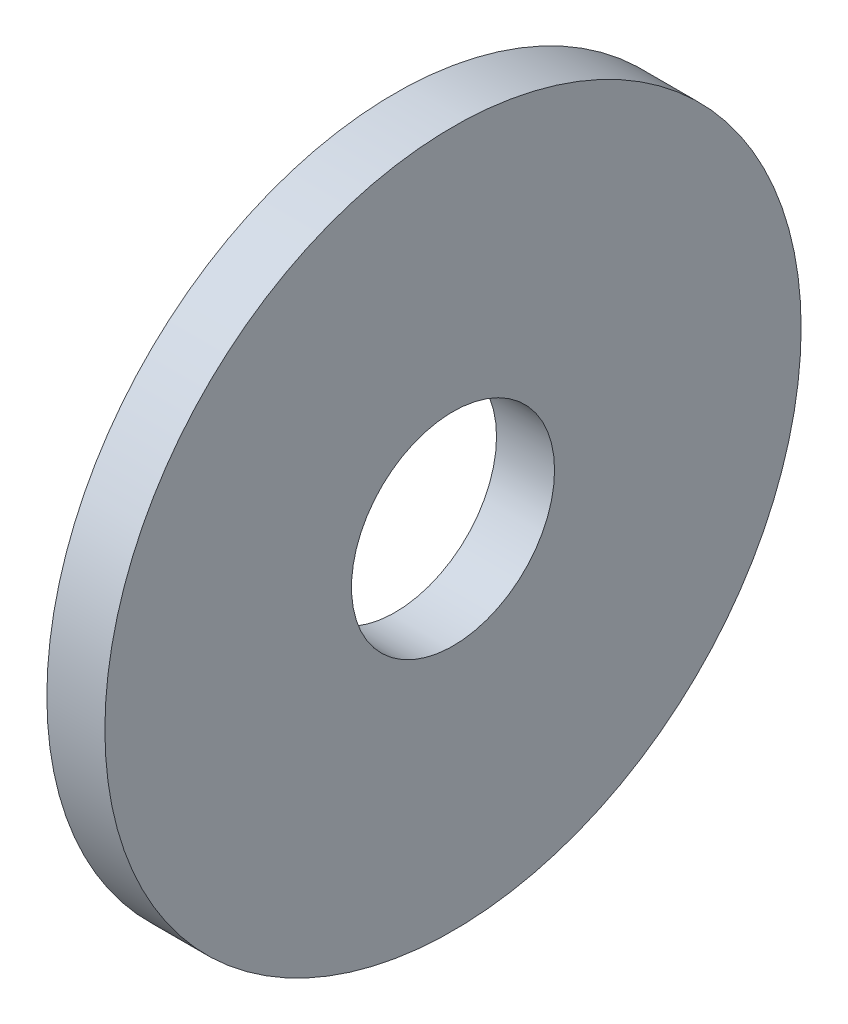
ISO-10303-21;
HEADER;
FILE_DESCRIPTION(('STEP AP214'),'2;1');
FILE_NAME('part.step','',(''),(''),'','','');
FILE_SCHEMA(('AUTOMOTIVE_DESIGN { 1 0 10303 214 1 1 1 1 }'));
ENDSEC;
DATA;
#1=APPLICATION_CONTEXT('core data for automotive mechanical design processes');
#2=APPLICATION_PROTOCOL_DEFINITION('international standard','automotive_design',2000,#1);
#3=PRODUCT_CONTEXT('',#1,'mechanical');
#4=PRODUCT('Part','Part','',(#3));
#5=PRODUCT_RELATED_PRODUCT_CATEGORY('part','',(#4));
#6=PRODUCT_DEFINITION_FORMATION('','',#4);
#7=PRODUCT_DEFINITION_CONTEXT('part definition',#1,'design');
#8=PRODUCT_DEFINITION('design','',#6,#7);
#9=PRODUCT_DEFINITION_SHAPE('','',#8);
#10=(LENGTH_UNIT() NAMED_UNIT(*) SI_UNIT(.MILLI.,.METRE.));
#11=(NAMED_UNIT(*) PLANE_ANGLE_UNIT() SI_UNIT($,.RADIAN.));
#12=(NAMED_UNIT(*) SI_UNIT($,.STERADIAN.) SOLID_ANGLE_UNIT());
#13=UNCERTAINTY_MEASURE_WITH_UNIT(LENGTH_MEASURE(1.E-05),#10,'distance_accuracy_value','');
#14=(GEOMETRIC_REPRESENTATION_CONTEXT(3) GLOBAL_UNCERTAINTY_ASSIGNED_CONTEXT((#13)) GLOBAL_UNIT_ASSIGNED_CONTEXT((#10,
#11,#12)) REPRESENTATION_CONTEXT('',''));
#15=CARTESIAN_POINT('',(0.,0.,0.));
#16=DIRECTION('',(0.,0.,1.));
#17=DIRECTION('',(1.,0.,0.));
#18=AXIS2_PLACEMENT_3D('',#15,#16,#17);
#19=CARTESIAN_POINT('',(1.,0.,0.));
#20=DIRECTION('',(1.,0.,0.));
#21=DIRECTION('',(0.,0.,-1.));
#22=AXIS2_PLACEMENT_3D('',#19,#20,#21);
#23=PLANE('',#22);
#24=CARTESIAN_POINT('',(1.,0.,0.));
#25=DIRECTION('',(1.,0.,0.));
#26=DIRECTION('',(0.,0.,-1.));
#27=AXIS2_PLACEMENT_3D('',#24,#25,#26);
#28=CIRCLE('',#27,6.);
#29=CARTESIAN_POINT('',(1.,0.,-6.));
#30=VERTEX_POINT('',#29);
#31=EDGE_CURVE('E10',#30,#30,#28,.T.);
#32=ORIENTED_EDGE('',*,*,#31,.T.);
#33=EDGE_LOOP('',(#32));
#34=FACE_BOUND('',#33,.T.);
#35=CARTESIAN_POINT('',(1.,0.,0.));
#36=DIRECTION('',(1.,0.,0.));
#37=DIRECTION('',(0.,0.,-1.));
#38=AXIS2_PLACEMENT_3D('',#35,#36,#37);
#39=CIRCLE('',#38,1.75);
#40=CARTESIAN_POINT('',(1.,0.,-1.75));
#41=VERTEX_POINT('',#40);
#42=EDGE_CURVE('E41',#41,#41,#39,.T.);
#43=ORIENTED_EDGE('',*,*,#42,.F.);
#44=EDGE_LOOP('',(#43));
#45=FACE_BOUND('',#44,.T.);
#46=ADVANCED_FACE('F30',(#34,#45),#23,.T.);
#47=CARTESIAN_POINT('',(0.,0.,0.));
#48=DIRECTION('',(1.,0.,0.));
#49=DIRECTION('',(0.,0.,-1.));
#50=AXIS2_PLACEMENT_3D('',#47,#48,#49);
#51=PLANE('',#50);
#52=CARTESIAN_POINT('',(0.,0.,0.));
#53=DIRECTION('',(1.,0.,0.));
#54=DIRECTION('',(0.,0.,-1.));
#55=AXIS2_PLACEMENT_3D('',#52,#53,#54);
#56=CIRCLE('',#55,6.);
#57=CARTESIAN_POINT('',(0.,0.,-6.));
#58=VERTEX_POINT('',#57);
#59=EDGE_CURVE('E34',#58,#58,#56,.T.);
#60=ORIENTED_EDGE('',*,*,#59,.F.);
#61=EDGE_LOOP('',(#60));
#62=FACE_BOUND('',#61,.T.);
#63=CARTESIAN_POINT('',(0.,0.,0.));
#64=DIRECTION('',(1.,0.,0.));
#65=DIRECTION('',(0.,0.,-1.));
#66=AXIS2_PLACEMENT_3D('',#63,#64,#65);
#67=CIRCLE('',#66,1.75);
#68=CARTESIAN_POINT('',(0.,0.,-1.75));
#69=VERTEX_POINT('',#68);
#70=EDGE_CURVE('E43',#69,#69,#67,.T.);
#71=ORIENTED_EDGE('',*,*,#70,.T.);
#72=EDGE_LOOP('',(#71));
#73=FACE_BOUND('',#72,.T.);
#74=ADVANCED_FACE('F53',(#62,#73),#51,.F.);
#75=CARTESIAN_POINT('',(1.,0.,0.));
#76=DIRECTION('',(-1.,0.,0.));
#77=DIRECTION('',(0.,0.,1.));
#78=AXIS2_PLACEMENT_3D('',#75,#76,#77);
#79=CYLINDRICAL_SURFACE('',#78,6.);
#80=ORIENTED_EDGE('',*,*,#31,.F.);
#81=EDGE_LOOP('',(#80));
#82=FACE_BOUND('',#81,.T.);
#83=ORIENTED_EDGE('',*,*,#59,.T.);
#84=EDGE_LOOP('',(#83));
#85=FACE_BOUND('',#84,.T.);
#86=ADVANCED_FACE('F32',(#82,#85),#79,.T.);
#87=CARTESIAN_POINT('',(1.,0.,0.));
#88=DIRECTION('',(-1.,0.,0.));
#89=DIRECTION('',(0.,0.,1.));
#90=AXIS2_PLACEMENT_3D('',#87,#88,#89);
#91=CYLINDRICAL_SURFACE('',#90,1.75);
#92=ORIENTED_EDGE('',*,*,#42,.T.);
#93=EDGE_LOOP('',(#92));
#94=FACE_BOUND('',#93,.T.);
#95=ORIENTED_EDGE('',*,*,#70,.F.);
#96=EDGE_LOOP('',(#95));
#97=FACE_BOUND('',#96,.T.);
#98=ADVANCED_FACE('F49',(#94,#97),#91,.F.);
#99=CLOSED_SHELL('',(#46,#74,#86,#98));
#100=MANIFOLD_SOLID_BREP('B2',#99);
#101=ADVANCED_BREP_SHAPE_REPRESENTATION('',(#18,#100),#14);
#102=SHAPE_DEFINITION_REPRESENTATION(#9,#101);
ENDSEC;
END-ISO-10303-21;
